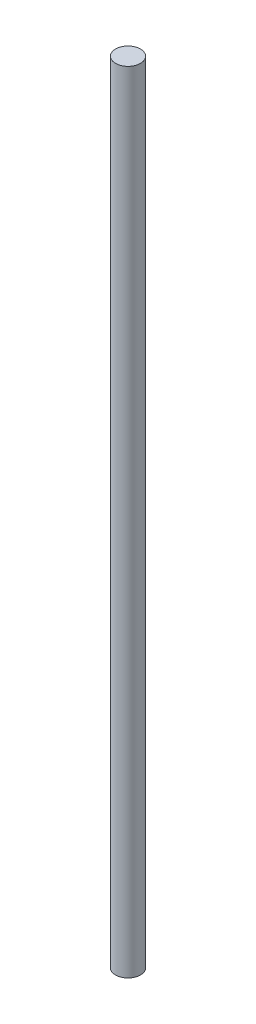
ISO-10303-21;
HEADER;
FILE_DESCRIPTION(('STEP AP214'),'2;1');
FILE_NAME('part.step','',(''),(''),'','','');
FILE_SCHEMA(('AUTOMOTIVE_DESIGN { 1 0 10303 214 1 1 1 1 }'));
ENDSEC;
DATA;
#1=APPLICATION_CONTEXT('core data for automotive mechanical design processes');
#2=APPLICATION_PROTOCOL_DEFINITION('international standard','automotive_design',2000,#1);
#3=PRODUCT_CONTEXT('',#1,'mechanical');
#4=PRODUCT('Part','Part','',(#3));
#5=PRODUCT_RELATED_PRODUCT_CATEGORY('part','',(#4));
#6=PRODUCT_DEFINITION_FORMATION('','',#4);
#7=PRODUCT_DEFINITION_CONTEXT('part definition',#1,'design');
#8=PRODUCT_DEFINITION('design','',#6,#7);
#9=PRODUCT_DEFINITION_SHAPE('','',#8);
#10=(LENGTH_UNIT() NAMED_UNIT(*) SI_UNIT(.MILLI.,.METRE.));
#11=(NAMED_UNIT(*) PLANE_ANGLE_UNIT() SI_UNIT($,.RADIAN.));
#12=(NAMED_UNIT(*) SI_UNIT($,.STERADIAN.) SOLID_ANGLE_UNIT());
#13=UNCERTAINTY_MEASURE_WITH_UNIT(LENGTH_MEASURE(1.E-05),#10,'distance_accuracy_value','');
#14=(GEOMETRIC_REPRESENTATION_CONTEXT(3) GLOBAL_UNCERTAINTY_ASSIGNED_CONTEXT((#13)) GLOBAL_UNIT_ASSIGNED_CONTEXT((#10,
#11,#12)) REPRESENTATION_CONTEXT('',''));
#15=CARTESIAN_POINT('',(0.,0.,0.));
#16=DIRECTION('',(0.,0.,1.));
#17=DIRECTION('',(1.,0.,0.));
#18=AXIS2_PLACEMENT_3D('',#15,#16,#17);
#19=CARTESIAN_POINT('',(0.,95.,0.));
#20=DIRECTION('',(0.,-1.,0.));
#21=DIRECTION('',(0.,0.,-1.));
#22=AXIS2_PLACEMENT_3D('',#19,#20,#21);
#23=CYLINDRICAL_SURFACE('',#22,1.5);
#24=CARTESIAN_POINT('',(0.,95.,0.));
#25=DIRECTION('',(0.,1.,0.));
#26=DIRECTION('',(0.,0.,1.));
#27=AXIS2_PLACEMENT_3D('',#24,#25,#26);
#28=CIRCLE('',#27,1.5);
#29=CARTESIAN_POINT('',(0.,95.,1.5));
#30=VERTEX_POINT('',#29);
#31=EDGE_CURVE('E10',#30,#30,#28,.T.);
#32=ORIENTED_EDGE('',*,*,#31,.F.);
#33=EDGE_LOOP('',(#32));
#34=FACE_BOUND('',#33,.T.);
#35=CARTESIAN_POINT('',(0.,0.,0.));
#36=DIRECTION('',(0.,1.,0.));
#37=DIRECTION('',(0.,0.,1.));
#38=AXIS2_PLACEMENT_3D('',#35,#36,#37);
#39=CIRCLE('',#38,1.5);
#40=CARTESIAN_POINT('',(0.,0.,1.5));
#41=VERTEX_POINT('',#40);
#42=EDGE_CURVE('E36',#41,#41,#39,.T.);
#43=ORIENTED_EDGE('',*,*,#42,.T.);
#44=EDGE_LOOP('',(#43));
#45=FACE_BOUND('',#44,.T.);
#46=ADVANCED_FACE('F33',(#34,#45),#23,.T.);
#47=CARTESIAN_POINT('',(0.,95.,0.));
#48=DIRECTION('',(0.,1.,0.));
#49=DIRECTION('',(0.,0.,1.));
#50=AXIS2_PLACEMENT_3D('',#47,#48,#49);
#51=PLANE('',#50);
#52=ORIENTED_EDGE('',*,*,#31,.T.);
#53=EDGE_LOOP('',(#52));
#54=FACE_BOUND('',#53,.T.);
#55=ADVANCED_FACE('F48',(#54),#51,.T.);
#56=CARTESIAN_POINT('',(0.,0.,0.));
#57=DIRECTION('',(0.,1.,0.));
#58=DIRECTION('',(0.,0.,1.));
#59=AXIS2_PLACEMENT_3D('',#56,#57,#58);
#60=PLANE('',#59);
#61=ORIENTED_EDGE('',*,*,#42,.F.);
#62=EDGE_LOOP('',(#61));
#63=FACE_BOUND('',#62,.T.);
#64=ADVANCED_FACE('F46',(#63),#60,.F.);
#65=CLOSED_SHELL('',(#46,#55,#64));
#66=MANIFOLD_SOLID_BREP('B2',#65);
#67=ADVANCED_BREP_SHAPE_REPRESENTATION('',(#18,#66),#14);
#68=SHAPE_DEFINITION_REPRESENTATION(#9,#67);
ENDSEC;
END-ISO-10303-21;
